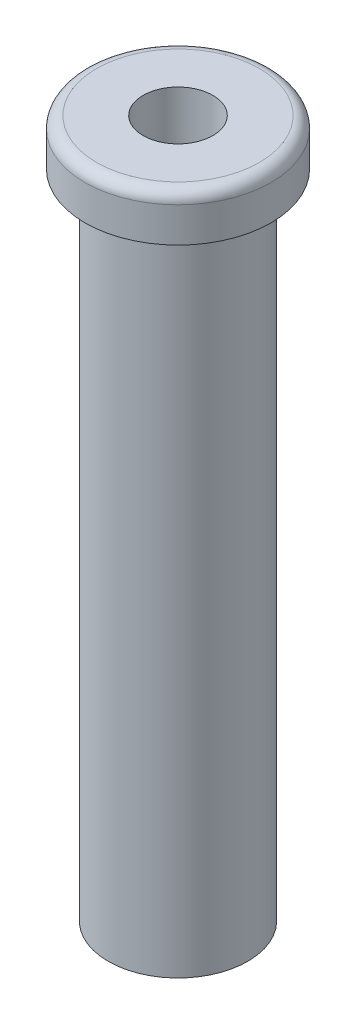
ISO-10303-21;
HEADER;
FILE_DESCRIPTION(('STEP AP214'),'2;1');
FILE_NAME('part.step','',(''),(''),'','','');
FILE_SCHEMA(('AUTOMOTIVE_DESIGN { 1 0 10303 214 1 1 1 1 }'));
ENDSEC;
DATA;
#1=APPLICATION_CONTEXT('core data for automotive mechanical design processes');
#2=APPLICATION_PROTOCOL_DEFINITION('international standard','automotive_design',2000,#1);
#3=PRODUCT_CONTEXT('',#1,'mechanical');
#4=PRODUCT('Part','Part','',(#3));
#5=PRODUCT_RELATED_PRODUCT_CATEGORY('part','',(#4));
#6=PRODUCT_DEFINITION_FORMATION('','',#4);
#7=PRODUCT_DEFINITION_CONTEXT('part definition',#1,'design');
#8=PRODUCT_DEFINITION('design','',#6,#7);
#9=PRODUCT_DEFINITION_SHAPE('','',#8);
#10=(LENGTH_UNIT() NAMED_UNIT(*) SI_UNIT(.MILLI.,.METRE.));
#11=(NAMED_UNIT(*) PLANE_ANGLE_UNIT() SI_UNIT($,.RADIAN.));
#12=(NAMED_UNIT(*) SI_UNIT($,.STERADIAN.) SOLID_ANGLE_UNIT());
#13=UNCERTAINTY_MEASURE_WITH_UNIT(LENGTH_MEASURE(1.E-05),#10,'distance_accuracy_value','');
#14=(GEOMETRIC_REPRESENTATION_CONTEXT(3) GLOBAL_UNCERTAINTY_ASSIGNED_CONTEXT((#13)) GLOBAL_UNIT_ASSIGNED_CONTEXT((#10,
#11,#12)) REPRESENTATION_CONTEXT('',''));
#15=CARTESIAN_POINT('',(0.,0.,0.));
#16=DIRECTION('',(0.,0.,1.));
#17=DIRECTION('',(1.,0.,0.));
#18=AXIS2_PLACEMENT_3D('',#15,#16,#17);
#19=CARTESIAN_POINT('',(0.,0.,0.));
#20=DIRECTION('',(0.,1.,0.));
#21=DIRECTION('',(0.,0.,1.));
#22=AXIS2_PLACEMENT_3D('',#19,#20,#21);
#23=PLANE('',#22);
#24=CARTESIAN_POINT('',(0.,0.,0.));
#25=DIRECTION('',(0.,1.,0.));
#26=DIRECTION('',(0.,0.,1.));
#27=AXIS2_PLACEMENT_3D('',#24,#25,#26);
#28=CIRCLE('',#27,6.);
#29=CARTESIAN_POINT('',(0.,0.,6.));
#30=VERTEX_POINT('',#29);
#31=EDGE_CURVE('E46',#30,#30,#28,.T.);
#32=ORIENTED_EDGE('',*,*,#31,.F.);
#33=EDGE_LOOP('',(#32));
#34=FACE_BOUND('',#33,.T.);
#35=CARTESIAN_POINT('',(0.,0.,0.));
#36=DIRECTION('',(0.,1.,0.));
#37=DIRECTION('',(0.,0.,1.));
#38=AXIS2_PLACEMENT_3D('',#35,#36,#37);
#39=CIRCLE('',#38,3.);
#40=CARTESIAN_POINT('',(0.,0.,3.));
#41=VERTEX_POINT('',#40);
#42=EDGE_CURVE('E50',#41,#41,#39,.T.);
#43=ORIENTED_EDGE('',*,*,#42,.T.);
#44=EDGE_LOOP('',(#43));
#45=FACE_BOUND('',#44,.T.);
#46=ADVANCED_FACE('F31',(#34,#45),#23,.F.);
#47=CARTESIAN_POINT('',(0.,56.,0.));
#48=DIRECTION('',(0.,-1.,0.));
#49=DIRECTION('',(0.,0.,-1.));
#50=AXIS2_PLACEMENT_3D('',#47,#48,#49);
#51=CYLINDRICAL_SURFACE('',#50,6.);
#52=CARTESIAN_POINT('',(0.,56.,0.));
#53=DIRECTION('',(0.,1.,0.));
#54=DIRECTION('',(0.,0.,1.));
#55=AXIS2_PLACEMENT_3D('',#52,#53,#54);
#56=CIRCLE('',#55,6.);
#57=CARTESIAN_POINT('',(0.,56.,6.));
#58=VERTEX_POINT('',#57);
#59=EDGE_CURVE('E42',#58,#58,#56,.T.);
#60=ORIENTED_EDGE('',*,*,#59,.F.);
#61=EDGE_LOOP('',(#60));
#62=FACE_BOUND('',#61,.T.);
#63=ORIENTED_EDGE('',*,*,#31,.T.);
#64=EDGE_LOOP('',(#63));
#65=FACE_BOUND('',#64,.T.);
#66=ADVANCED_FACE('F74',(#62,#65),#51,.T.);
#67=CARTESIAN_POINT('',(0.,56.,0.));
#68=DIRECTION('',(0.,-1.,0.));
#69=DIRECTION('',(0.,0.,-1.));
#70=AXIS2_PLACEMENT_3D('',#67,#68,#69);
#71=CYLINDRICAL_SURFACE('',#70,3.);
#72=ORIENTED_EDGE('',*,*,#42,.F.);
#73=EDGE_LOOP('',(#72));
#74=FACE_BOUND('',#73,.T.);
#75=CARTESIAN_POINT('',(0.,60.,0.));
#76=DIRECTION('',(0.,1.,0.));
#77=DIRECTION('',(0.,0.,1.));
#78=AXIS2_PLACEMENT_3D('',#75,#76,#77);
#79=CIRCLE('',#78,3.);
#80=CARTESIAN_POINT('',(0.,60.,3.));
#81=VERTEX_POINT('',#80);
#82=EDGE_CURVE('E57',#81,#81,#79,.T.);
#83=ORIENTED_EDGE('',*,*,#82,.T.);
#84=EDGE_LOOP('',(#83));
#85=FACE_BOUND('',#84,.T.);
#86=ADVANCED_FACE('F61',(#74,#85),#71,.F.);
#87=CARTESIAN_POINT('',(0.,60.,0.));
#88=DIRECTION('',(0.,1.,0.));
#89=DIRECTION('',(0.,0.,1.));
#90=AXIS2_PLACEMENT_3D('',#87,#88,#89);
#91=PLANE('',#90);
#92=CARTESIAN_POINT('',(0.,60.,0.));
#93=DIRECTION('',(0.,1.,0.));
#94=DIRECTION('',(0.,0.,1.));
#95=AXIS2_PLACEMENT_3D('',#92,#93,#94);
#96=CIRCLE('',#95,7.);
#97=CARTESIAN_POINT('',(0.,60.,7.));
#98=VERTEX_POINT('',#97);
#99=EDGE_CURVE('E38',#98,#98,#96,.T.);
#100=ORIENTED_EDGE('',*,*,#99,.T.);
#101=EDGE_LOOP('',(#100));
#102=FACE_BOUND('',#101,.T.);
#103=ORIENTED_EDGE('',*,*,#82,.F.);
#104=EDGE_LOOP('',(#103));
#105=FACE_BOUND('',#104,.T.);
#106=ADVANCED_FACE('F63',(#102,#105),#91,.T.);
#107=CARTESIAN_POINT('',(0.,56.,0.));
#108=DIRECTION('',(0.,1.,0.));
#109=DIRECTION('',(0.,0.,1.));
#110=AXIS2_PLACEMENT_3D('',#107,#108,#109);
#111=PLANE('',#110);
#112=ORIENTED_EDGE('',*,*,#59,.T.);
#113=EDGE_LOOP('',(#112));
#114=FACE_BOUND('',#113,.T.);
#115=CARTESIAN_POINT('',(0.,56.,0.));
#116=DIRECTION('',(0.,1.,0.));
#117=DIRECTION('',(0.,0.,1.));
#118=AXIS2_PLACEMENT_3D('',#115,#116,#117);
#119=CIRCLE('',#118,8.);
#120=CARTESIAN_POINT('',(0.,56.,8.));
#121=VERTEX_POINT('',#120);
#122=EDGE_CURVE('E54',#121,#121,#119,.T.);
#123=ORIENTED_EDGE('',*,*,#122,.F.);
#124=EDGE_LOOP('',(#123));
#125=FACE_BOUND('',#124,.T.);
#126=ADVANCED_FACE('F65',(#114,#125),#111,.F.);
#127=CARTESIAN_POINT('',(0.,60.,0.));
#128=DIRECTION('',(0.,-1.,0.));
#129=DIRECTION('',(0.,0.,-1.));
#130=AXIS2_PLACEMENT_3D('',#127,#128,#129);
#131=CYLINDRICAL_SURFACE('',#130,8.);
#132=CARTESIAN_POINT('',(0.,59.,0.));
#133=DIRECTION('',(0.,1.,0.));
#134=DIRECTION('',(0.,0.,1.));
#135=AXIS2_PLACEMENT_3D('',#132,#133,#134);
#136=CIRCLE('',#135,8.);
#137=CARTESIAN_POINT('',(0.,59.,8.));
#138=VERTEX_POINT('',#137);
#139=EDGE_CURVE('E10',#138,#138,#136,.F.);
#140=ORIENTED_EDGE('',*,*,#139,.T.);
#141=EDGE_LOOP('',(#140));
#142=FACE_BOUND('',#141,.T.);
#143=ORIENTED_EDGE('',*,*,#122,.T.);
#144=EDGE_LOOP('',(#143));
#145=FACE_BOUND('',#144,.T.);
#146=ADVANCED_FACE('F71',(#142,#145),#131,.T.);
#147=CARTESIAN_POINT('',(0.,59.,0.));
#148=DIRECTION('',(0.,1.,0.));
#149=DIRECTION('',(0.,0.,1.));
#150=AXIS2_PLACEMENT_3D('',#147,#148,#149);
#151=TOROIDAL_SURFACE('',#150,7.,1.);
#152=ORIENTED_EDGE('',*,*,#139,.F.);
#153=EDGE_LOOP('',(#152));
#154=FACE_BOUND('',#153,.T.);
#155=ORIENTED_EDGE('',*,*,#99,.F.);
#156=EDGE_LOOP('',(#155));
#157=FACE_BOUND('',#156,.T.);
#158=ADVANCED_FACE('F33',(#154,#157),#151,.T.);
#159=CLOSED_SHELL('',(#46,#66,#86,#106,#126,#146,#158));
#160=MANIFOLD_SOLID_BREP('B2',#159);
#161=ADVANCED_BREP_SHAPE_REPRESENTATION('',(#18,#160),#14);
#162=SHAPE_DEFINITION_REPRESENTATION(#9,#161);
ENDSEC;
END-ISO-10303-21;
